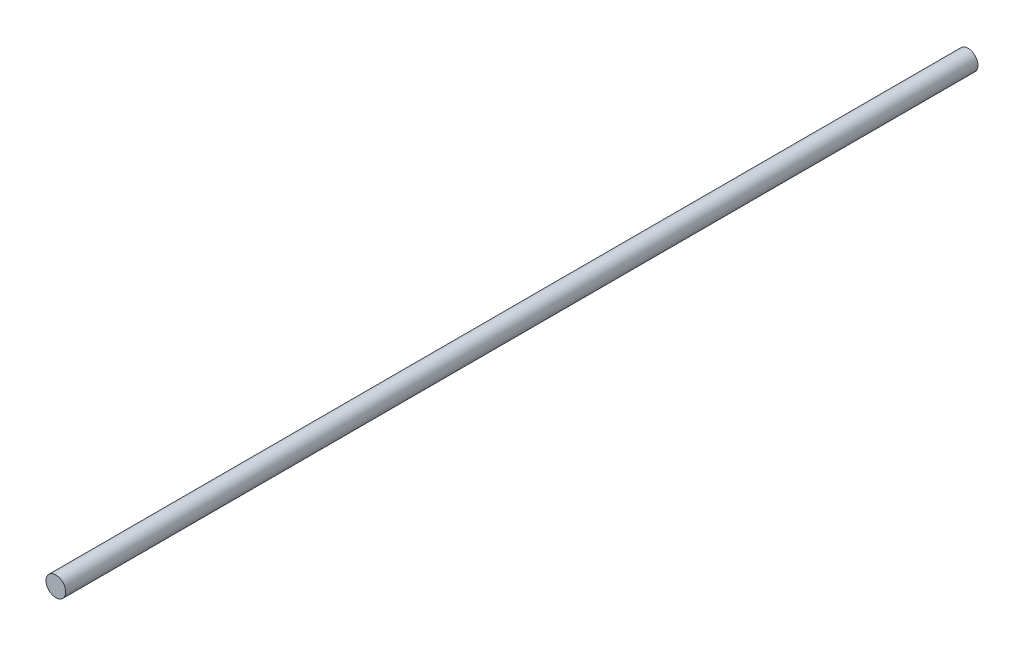
ISO-10303-21;
HEADER;
FILE_DESCRIPTION(('STEP AP214'),'2;1');
FILE_NAME('part.step','',(''),(''),'','','');
FILE_SCHEMA(('AUTOMOTIVE_DESIGN { 1 0 10303 214 1 1 1 1 }'));
ENDSEC;
DATA;
#1=APPLICATION_CONTEXT('core data for automotive mechanical design processes');
#2=APPLICATION_PROTOCOL_DEFINITION('international standard','automotive_design',2000,#1);
#3=PRODUCT_CONTEXT('',#1,'mechanical');
#4=PRODUCT('Part','Part','',(#3));
#5=PRODUCT_RELATED_PRODUCT_CATEGORY('part','',(#4));
#6=PRODUCT_DEFINITION_FORMATION('','',#4);
#7=PRODUCT_DEFINITION_CONTEXT('part definition',#1,'design');
#8=PRODUCT_DEFINITION('design','',#6,#7);
#9=PRODUCT_DEFINITION_SHAPE('','',#8);
#10=(LENGTH_UNIT() NAMED_UNIT(*) SI_UNIT(.MILLI.,.METRE.));
#11=(NAMED_UNIT(*) PLANE_ANGLE_UNIT() SI_UNIT($,.RADIAN.));
#12=(NAMED_UNIT(*) SI_UNIT($,.STERADIAN.) SOLID_ANGLE_UNIT());
#13=UNCERTAINTY_MEASURE_WITH_UNIT(LENGTH_MEASURE(1.E-05),#10,'distance_accuracy_value','');
#14=(GEOMETRIC_REPRESENTATION_CONTEXT(3) GLOBAL_UNCERTAINTY_ASSIGNED_CONTEXT((#13)) GLOBAL_UNIT_ASSIGNED_CONTEXT((#10,
#11,#12)) REPRESENTATION_CONTEXT('',''));
#15=CARTESIAN_POINT('',(0.,0.,0.));
#16=DIRECTION('',(0.,0.,1.));
#17=DIRECTION('',(1.,0.,0.));
#18=AXIS2_PLACEMENT_3D('',#15,#16,#17);
#19=CARTESIAN_POINT('',(0.,0.,369.52));
#20=DIRECTION('',(0.,0.,-1.));
#21=DIRECTION('',(-1.,0.,0.));
#22=AXIS2_PLACEMENT_3D('',#19,#20,#21);
#23=CYLINDRICAL_SURFACE('',#22,4.);
#24=CARTESIAN_POINT('',(0.,0.,369.52));
#25=DIRECTION('',(0.,0.,1.));
#26=DIRECTION('',(1.,0.,0.));
#27=AXIS2_PLACEMENT_3D('',#24,#25,#26);
#28=CIRCLE('',#27,4.);
#29=CARTESIAN_POINT('',(4.,0.,369.52));
#30=VERTEX_POINT('',#29);
#31=EDGE_CURVE('E10',#30,#30,#28,.T.);
#32=ORIENTED_EDGE('',*,*,#31,.F.);
#33=EDGE_LOOP('',(#32));
#34=FACE_BOUND('',#33,.T.);
#35=CARTESIAN_POINT('',(0.,0.,0.));
#36=DIRECTION('',(0.,0.,1.));
#37=DIRECTION('',(1.,0.,0.));
#38=AXIS2_PLACEMENT_3D('',#35,#36,#37);
#39=CIRCLE('',#38,4.);
#40=CARTESIAN_POINT('',(4.,0.,0.));
#41=VERTEX_POINT('',#40);
#42=EDGE_CURVE('E34',#41,#41,#39,.T.);
#43=ORIENTED_EDGE('',*,*,#42,.T.);
#44=EDGE_LOOP('',(#43));
#45=FACE_BOUND('',#44,.T.);
#46=ADVANCED_FACE('F31',(#34,#45),#23,.T.);
#47=CARTESIAN_POINT('',(0.,0.,369.52));
#48=DIRECTION('',(0.,0.,1.));
#49=DIRECTION('',(1.,0.,0.));
#50=AXIS2_PLACEMENT_3D('',#47,#48,#49);
#51=PLANE('',#50);
#52=ORIENTED_EDGE('',*,*,#31,.T.);
#53=EDGE_LOOP('',(#52));
#54=FACE_BOUND('',#53,.T.);
#55=ADVANCED_FACE('F46',(#54),#51,.T.);
#56=CARTESIAN_POINT('',(0.,0.,0.));
#57=DIRECTION('',(0.,0.,1.));
#58=DIRECTION('',(1.,0.,0.));
#59=AXIS2_PLACEMENT_3D('',#56,#57,#58);
#60=PLANE('',#59);
#61=ORIENTED_EDGE('',*,*,#42,.F.);
#62=EDGE_LOOP('',(#61));
#63=FACE_BOUND('',#62,.T.);
#64=ADVANCED_FACE('F44',(#63),#60,.F.);
#65=CLOSED_SHELL('',(#46,#55,#64));
#66=MANIFOLD_SOLID_BREP('B2',#65);
#67=ADVANCED_BREP_SHAPE_REPRESENTATION('',(#18,#66),#14);
#68=SHAPE_DEFINITION_REPRESENTATION(#9,#67);
ENDSEC;
END-ISO-10303-21;
